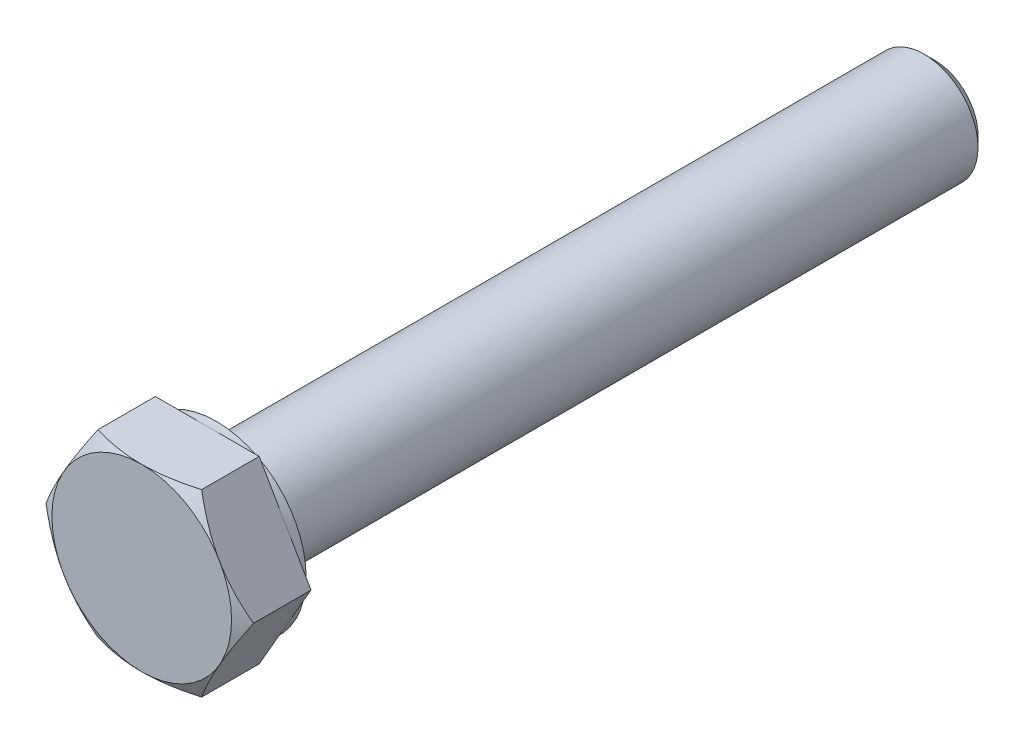
ISO-10303-21;
HEADER;
FILE_DESCRIPTION(('STEP AP214'),'2;1');
FILE_NAME('part.step','',(''),(''),'','','');
FILE_SCHEMA(('AUTOMOTIVE_DESIGN { 1 0 10303 214 1 1 1 1 }'));
ENDSEC;
DATA;
#1=APPLICATION_CONTEXT('core data for automotive mechanical design processes');
#2=APPLICATION_PROTOCOL_DEFINITION('international standard','automotive_design',2000,#1);
#3=PRODUCT_CONTEXT('',#1,'mechanical');
#4=PRODUCT('Part','Part','',(#3));
#5=PRODUCT_RELATED_PRODUCT_CATEGORY('part','',(#4));
#6=PRODUCT_DEFINITION_FORMATION('','',#4);
#7=PRODUCT_DEFINITION_CONTEXT('part definition',#1,'design');
#8=PRODUCT_DEFINITION('design','',#6,#7);
#9=PRODUCT_DEFINITION_SHAPE('','',#8);
#10=(LENGTH_UNIT() NAMED_UNIT(*) SI_UNIT(.MILLI.,.METRE.));
#11=(NAMED_UNIT(*) PLANE_ANGLE_UNIT() SI_UNIT($,.RADIAN.));
#12=(NAMED_UNIT(*) SI_UNIT($,.STERADIAN.) SOLID_ANGLE_UNIT());
#13=UNCERTAINTY_MEASURE_WITH_UNIT(LENGTH_MEASURE(1.E-05),#10,'distance_accuracy_value','');
#14=(GEOMETRIC_REPRESENTATION_CONTEXT(3) GLOBAL_UNCERTAINTY_ASSIGNED_CONTEXT((#13)) GLOBAL_UNIT_ASSIGNED_CONTEXT((#10,
#11,#12)) REPRESENTATION_CONTEXT('',''));
#15=CARTESIAN_POINT('',(0.,0.,0.));
#16=DIRECTION('',(0.,0.,1.));
#17=DIRECTION('',(1.,0.,0.));
#18=AXIS2_PLACEMENT_3D('',#15,#16,#17);
#19=CARTESIAN_POINT('',(0.,0.,4.15));
#20=DIRECTION('',(0.,0.,1.));
#21=DIRECTION('',(1.,0.,0.));
#22=AXIS2_PLACEMENT_3D('',#19,#20,#21);
#23=PLANE('',#22);
#24=CARTESIAN_POINT('',(0.,0.,4.15));
#25=DIRECTION('',(0.,0.,1.));
#26=DIRECTION('',(1.,0.,0.));
#27=AXIS2_PLACEMENT_3D('',#24,#25,#26);
#28=CIRCLE('',#27,5.);
#29=CARTESIAN_POINT('',(5.,0.,4.15));
#30=VERTEX_POINT('',#29);
#31=EDGE_CURVE('E10',#30,#30,#28,.T.);
#32=ORIENTED_EDGE('',*,*,#31,.T.);
#33=EDGE_LOOP('',(#32));
#34=FACE_BOUND('',#33,.T.);
#35=ADVANCED_FACE('F15',(#34),#23,.T.);
#36=CARTESIAN_POINT('',(0.,0.,4.15));
#37=DIRECTION('',(0.,0.,-1.));
#38=DIRECTION('',(1.,0.,0.));
#39=AXIS2_PLACEMENT_3D('',#36,#37,#38);
#40=CONICAL_SURFACE('',#39,5.,1.047197551197);
#41=CARTESIAN_POINT('',(2.8874999999992,5.00129670685568,3.70255354137743));
#42=CARTESIAN_POINT('',(4.33124999999986,2.50064835342825,4.53610299252072));
#43=CARTESIAN_POINT('',(5.77500000000043,9.62341317745086E-13,3.70255354137764));
#44=(BOUNDED_CURVE() B_SPLINE_CURVE(2,(#41,#42,#43),.UNSPECIFIED.,.F.,
.F.) B_SPLINE_CURVE_WITH_KNOTS((3,3),(0.,1.),
.UNSPECIFIED.) CURVE() GEOMETRIC_REPRESENTATION_ITEM() RATIONAL_B_SPLINE_CURVE((1.,
1.15470053837938,1.)) REPRESENTATION_ITEM(''));
#45=CARTESIAN_POINT('',(2.8875,5.001296706855,3.702553541378));
#46=VERTEX_POINT('',#45);
#47=CARTESIAN_POINT('',(5.775,0.,3.702553541378));
#48=VERTEX_POINT('',#47);
#49=EDGE_CURVE('E125',#46,#48,#44,.T.);
#50=ORIENTED_EDGE('',*,*,#49,.F.);
#51=CARTESIAN_POINT('',(-2.88750000000039,5.001296706855,3.70255354137778));
#52=CARTESIAN_POINT('',(-1.94066984704477E-13,5.00129670685504,4.53610299252048));
#53=CARTESIAN_POINT('',(2.88749999999987,5.001296706855,3.70255354137793));
#54=(BOUNDED_CURVE() B_SPLINE_CURVE(2,(#51,#52,#53),.UNSPECIFIED.,.F.,
.F.) B_SPLINE_CURVE_WITH_KNOTS((3,3),(0.,1.),
.UNSPECIFIED.) CURVE() GEOMETRIC_REPRESENTATION_ITEM() RATIONAL_B_SPLINE_CURVE((1.,
1.15470053837927,1.)) REPRESENTATION_ITEM(''));
#55=CARTESIAN_POINT('',(-2.8875,5.001296706855,3.702553541378));
#56=VERTEX_POINT('',#55);
#57=EDGE_CURVE('E111',#56,#46,#54,.T.);
#58=ORIENTED_EDGE('',*,*,#57,.F.);
#59=CARTESIAN_POINT('',(-5.7750000000016,-1.0627054791712E-12,3.70255354137697));
#60=CARTESIAN_POINT('',(-4.33125000000055,2.50064835342705,4.53610299252083));
#61=CARTESIAN_POINT('',(-2.88749999999986,5.00129670685454,3.70255354137781));
#62=(BOUNDED_CURVE() B_SPLINE_CURVE(2,(#59,#60,#61),.UNSPECIFIED.,.F.,
.F.) B_SPLINE_CURVE_WITH_KNOTS((3,3),(0.,1.),
.UNSPECIFIED.) CURVE() GEOMETRIC_REPRESENTATION_ITEM() RATIONAL_B_SPLINE_CURVE((1.,
1.15470053837943,1.)) REPRESENTATION_ITEM(''));
#63=CARTESIAN_POINT('',(-5.775,0.,3.702553541378));
#64=VERTEX_POINT('',#63);
#65=EDGE_CURVE('E159',#64,#56,#62,.T.);
#66=ORIENTED_EDGE('',*,*,#65,.F.);
#67=CARTESIAN_POINT('',(-2.8874999999992,-5.00129670685568,3.70255354137743));
#68=CARTESIAN_POINT('',(-4.33124999999987,-2.50064835342823,4.53610299252073));
#69=CARTESIAN_POINT('',(-5.77500000000045,-9.2104102122903E-13,3.70255354137763));
#70=(BOUNDED_CURVE() B_SPLINE_CURVE(2,(#67,#68,#69),.UNSPECIFIED.,.F.,
.F.) B_SPLINE_CURVE_WITH_KNOTS((3,3),(0.,1.),
.UNSPECIFIED.) CURVE() GEOMETRIC_REPRESENTATION_ITEM() RATIONAL_B_SPLINE_CURVE((1.,
1.15470053837938,1.)) REPRESENTATION_ITEM(''));
#71=CARTESIAN_POINT('',(-2.8875,-5.001296706855,3.702553541378));
#72=VERTEX_POINT('',#71);
#73=EDGE_CURVE('E171',#72,#64,#70,.T.);
#74=ORIENTED_EDGE('',*,*,#73,.F.);
#75=CARTESIAN_POINT('',(2.88750000000039,-5.001296706855,3.70255354137778));
#76=CARTESIAN_POINT('',(1.93622895494628E-13,-5.00129670685504,4.53610299252048));
#77=CARTESIAN_POINT('',(-2.88749999999987,-5.001296706855,3.70255354137793));
#78=(BOUNDED_CURVE() B_SPLINE_CURVE(2,(#75,#76,#77),.UNSPECIFIED.,.F.,
.F.) B_SPLINE_CURVE_WITH_KNOTS((3,3),(0.,1.),
.UNSPECIFIED.) CURVE() GEOMETRIC_REPRESENTATION_ITEM() RATIONAL_B_SPLINE_CURVE((1.,
1.15470053837927,1.)) REPRESENTATION_ITEM(''));
#79=CARTESIAN_POINT('',(2.8875,-5.001296706855,3.702553541378));
#80=VERTEX_POINT('',#79);
#81=EDGE_CURVE('E184',#80,#72,#78,.T.);
#82=ORIENTED_EDGE('',*,*,#81,.F.);
#83=CARTESIAN_POINT('',(5.77500000000167,1.18571819029967E-12,3.70255354137693));
#84=CARTESIAN_POINT('',(4.33125000000057,-2.50064835342701,4.53610299252084));
#85=CARTESIAN_POINT('',(2.88749999999986,-5.00129670685454,3.70255354137781));
#86=(BOUNDED_CURVE() B_SPLINE_CURVE(2,(#83,#84,#85),.UNSPECIFIED.,.F.,
.F.) B_SPLINE_CURVE_WITH_KNOTS((3,3),(0.,1.),
.UNSPECIFIED.) CURVE() GEOMETRIC_REPRESENTATION_ITEM() RATIONAL_B_SPLINE_CURVE((1.,
1.15470053837944,1.)) REPRESENTATION_ITEM(''));
#87=EDGE_CURVE('E18',#48,#80,#86,.T.);
#88=ORIENTED_EDGE('',*,*,#87,.F.);
#89=DIRECTION('',(0.866025403784329,0.,-0.50000000000019));
#90=VECTOR('',#89,1.);
#91=CARTESIAN_POINT('',(5.,0.,4.15));
#92=LINE('',#91,#90);
#93=EDGE_CURVE('E26',#30,#48,#92,.T.);
#94=ORIENTED_EDGE('',*,*,#93,.F.);
#95=ORIENTED_EDGE('',*,*,#31,.F.);
#96=ORIENTED_EDGE('',*,*,#93,.T.);
#97=EDGE_LOOP('',(#50,#58,#66,#74,#82,#88,#94,#95,#96));
#98=FACE_BOUND('',#97,.T.);
#99=ADVANCED_FACE('F126',(#98),#40,.T.);
#100=CARTESIAN_POINT('',(2.8875,-5.001296706855,0.));
#101=DIRECTION('',(-0.866025403784329,0.50000000000019,0.));
#102=DIRECTION('',(0.,0.,1.));
#103=AXIS2_PLACEMENT_3D('',#100,#101,#102);
#104=PLANE('',#103);
#105=DIRECTION('',(0.,0.,1.));
#106=VECTOR('',#105,1.);
#107=CARTESIAN_POINT('',(5.775,0.,0.5));
#108=LINE('',#107,#106);
#109=CARTESIAN_POINT('',(5.775,0.,0.5));
#110=VERTEX_POINT('',#109);
#111=EDGE_CURVE('E130',#110,#48,#108,.T.);
#112=ORIENTED_EDGE('',*,*,#111,.T.);
#113=ORIENTED_EDGE('',*,*,#87,.T.);
#114=DIRECTION('',(0.,0.,1.));
#115=VECTOR('',#114,1.);
#116=CARTESIAN_POINT('',(2.8875,-5.001296706855,0.));
#117=LINE('',#116,#115);
#118=CARTESIAN_POINT('',(2.8875,-5.001296706855,0.5));
#119=VERTEX_POINT('',#118);
#120=EDGE_CURVE('E176',#119,#80,#117,.T.);
#121=ORIENTED_EDGE('',*,*,#120,.F.);
#122=DIRECTION('',(0.50000000000019,0.866025403784329,0.));
#123=VECTOR('',#122,1.);
#124=CARTESIAN_POINT('',(3.609375,-3.750972530141,0.5));
#125=LINE('',#124,#123);
#126=EDGE_CURVE('E366',#119,#110,#125,.T.);
#127=ORIENTED_EDGE('',*,*,#126,.T.);
#128=EDGE_LOOP('',(#112,#113,#121,#127));
#129=FACE_BOUND('',#128,.T.);
#130=ADVANCED_FACE('F252',(#129),#104,.F.);
#131=CARTESIAN_POINT('',(-2.8875,-5.001296706855,0.));
#132=DIRECTION('',(0.,1.,0.));
#133=DIRECTION('',(1.,0.,0.));
#134=AXIS2_PLACEMENT_3D('',#131,#132,#133);
#135=PLANE('',#134);
#136=ORIENTED_EDGE('',*,*,#120,.T.);
#137=ORIENTED_EDGE('',*,*,#81,.T.);
#138=DIRECTION('',(0.,0.,1.));
#139=VECTOR('',#138,1.);
#140=CARTESIAN_POINT('',(-2.8875,-5.001296706855,0.));
#141=LINE('',#140,#139);
#142=CARTESIAN_POINT('',(-2.8875,-5.001296706855,0.5));
#143=VERTEX_POINT('',#142);
#144=EDGE_CURVE('E164',#143,#72,#141,.T.);
#145=ORIENTED_EDGE('',*,*,#144,.F.);
#146=DIRECTION('',(1.,0.,0.));
#147=VECTOR('',#146,1.);
#148=CARTESIAN_POINT('',(-1.44375,-5.001296706855,0.5));
#149=LINE('',#148,#147);
#150=EDGE_CURVE('E363',#143,#119,#149,.T.);
#151=ORIENTED_EDGE('',*,*,#150,.T.);
#152=EDGE_LOOP('',(#136,#137,#145,#151));
#153=FACE_BOUND('',#152,.T.);
#154=ADVANCED_FACE('F263',(#153),#135,.F.);
#155=CARTESIAN_POINT('',(-5.775,0.,0.));
#156=DIRECTION('',(0.866025403784329,0.50000000000019,0.));
#157=DIRECTION('',(0.,0.,-1.));
#158=AXIS2_PLACEMENT_3D('',#155,#156,#157);
#159=PLANE('',#158);
#160=ORIENTED_EDGE('',*,*,#144,.T.);
#161=ORIENTED_EDGE('',*,*,#73,.T.);
#162=DIRECTION('',(0.,0.,1.));
#163=VECTOR('',#162,1.);
#164=CARTESIAN_POINT('',(-5.775,0.,0.));
#165=LINE('',#164,#163);
#166=CARTESIAN_POINT('',(-5.775,0.,0.5));
#167=VERTEX_POINT('',#166);
#168=EDGE_CURVE('E122',#167,#64,#165,.T.);
#169=ORIENTED_EDGE('',*,*,#168,.F.);
#170=DIRECTION('',(0.50000000000019,-0.866025403784329,0.));
#171=VECTOR('',#170,1.);
#172=CARTESIAN_POINT('',(-5.053125,-1.250324176714,0.5));
#173=LINE('',#172,#171);
#174=EDGE_CURVE('E381',#167,#143,#173,.T.);
#175=ORIENTED_EDGE('',*,*,#174,.T.);
#176=EDGE_LOOP('',(#160,#161,#169,#175));
#177=FACE_BOUND('',#176,.T.);
#178=ADVANCED_FACE('F313',(#177),#159,.F.);
#179=CARTESIAN_POINT('',(-2.8875,5.001296706855,0.));
#180=DIRECTION('',(0.866025403784329,-0.50000000000019,0.));
#181=DIRECTION('',(0.,0.,-1.));
#182=AXIS2_PLACEMENT_3D('',#179,#180,#181);
#183=PLANE('',#182);
#184=ORIENTED_EDGE('',*,*,#168,.T.);
#185=ORIENTED_EDGE('',*,*,#65,.T.);
#186=DIRECTION('',(0.,0.,1.));
#187=VECTOR('',#186,1.);
#188=CARTESIAN_POINT('',(-2.8875,5.001296706855,0.));
#189=LINE('',#188,#187);
#190=CARTESIAN_POINT('',(-2.8875,5.001296706855,0.5));
#191=VERTEX_POINT('',#190);
#192=EDGE_CURVE('E118',#191,#56,#189,.T.);
#193=ORIENTED_EDGE('',*,*,#192,.F.);
#194=DIRECTION('',(-0.50000000000019,-0.866025403784329,0.));
#195=VECTOR('',#194,1.);
#196=CARTESIAN_POINT('',(-3.609375,3.750972530141,0.5));
#197=LINE('',#196,#195);
#198=EDGE_CURVE('E143',#191,#167,#197,.T.);
#199=ORIENTED_EDGE('',*,*,#198,.T.);
#200=EDGE_LOOP('',(#184,#185,#193,#199));
#201=FACE_BOUND('',#200,.T.);
#202=ADVANCED_FACE('F303',(#201),#183,.F.);
#203=CARTESIAN_POINT('',(2.8875,5.001296706855,0.));
#204=DIRECTION('',(0.,-1.,0.));
#205=DIRECTION('',(-1.,0.,0.));
#206=AXIS2_PLACEMENT_3D('',#203,#204,#205);
#207=PLANE('',#206);
#208=ORIENTED_EDGE('',*,*,#192,.T.);
#209=ORIENTED_EDGE('',*,*,#57,.T.);
#210=DIRECTION('',(0.,0.,1.));
#211=VECTOR('',#210,1.);
#212=CARTESIAN_POINT('',(2.8875,5.001296706855,0.));
#213=LINE('',#212,#211);
#214=CARTESIAN_POINT('',(2.8875,5.001296706855,0.5));
#215=VERTEX_POINT('',#214);
#216=EDGE_CURVE('E116',#215,#46,#213,.T.);
#217=ORIENTED_EDGE('',*,*,#216,.F.);
#218=DIRECTION('',(-1.,0.,0.));
#219=VECTOR('',#218,1.);
#220=CARTESIAN_POINT('',(1.44375,5.001296706855,0.5));
#221=LINE('',#220,#219);
#222=EDGE_CURVE('E137',#215,#191,#221,.T.);
#223=ORIENTED_EDGE('',*,*,#222,.T.);
#224=EDGE_LOOP('',(#208,#209,#217,#223));
#225=FACE_BOUND('',#224,.T.);
#226=ADVANCED_FACE('F113',(#225),#207,.F.);
#227=CARTESIAN_POINT('',(5.775,0.,0.));
#228=DIRECTION('',(-0.866025403784329,-0.50000000000019,0.));
#229=DIRECTION('',(-0.50000000000019,0.866025403784329,0.));
#230=AXIS2_PLACEMENT_3D('',#227,#228,#229);
#231=PLANE('',#230);
#232=ORIENTED_EDGE('',*,*,#216,.T.);
#233=ORIENTED_EDGE('',*,*,#49,.T.);
#234=ORIENTED_EDGE('',*,*,#111,.F.);
#235=DIRECTION('',(-0.50000000000019,0.866025403784329,0.));
#236=VECTOR('',#235,1.);
#237=CARTESIAN_POINT('',(5.053125,1.250324176714,0.5));
#238=LINE('',#237,#236);
#239=EDGE_CURVE('E135',#110,#215,#238,.T.);
#240=ORIENTED_EDGE('',*,*,#239,.T.);
#241=EDGE_LOOP('',(#232,#233,#234,#240));
#242=FACE_BOUND('',#241,.T.);
#243=ADVANCED_FACE('F133',(#242),#231,.F.);
#244=CARTESIAN_POINT('',(0.,0.,0.5));
#245=DIRECTION('',(0.,0.,1.));
#246=DIRECTION('',(1.,0.,0.));
#247=AXIS2_PLACEMENT_3D('',#244,#245,#246);
#248=PLANE('',#247);
#249=CARTESIAN_POINT('',(0.,0.,0.5));
#250=DIRECTION('',(0.,0.,1.));
#251=DIRECTION('',(1.,0.,0.));
#252=AXIS2_PLACEMENT_3D('',#249,#250,#251);
#253=CIRCLE('',#252,5.);
#254=CARTESIAN_POINT('',(5.,0.,0.5));
#255=VERTEX_POINT('',#254);
#256=EDGE_CURVE('E372',#255,#255,#253,.T.);
#257=ORIENTED_EDGE('',*,*,#256,.T.);
#258=EDGE_LOOP('',(#257));
#259=FACE_BOUND('',#258,.T.);
#260=ORIENTED_EDGE('',*,*,#239,.F.);
#261=ORIENTED_EDGE('',*,*,#126,.F.);
#262=ORIENTED_EDGE('',*,*,#150,.F.);
#263=ORIENTED_EDGE('',*,*,#174,.F.);
#264=ORIENTED_EDGE('',*,*,#198,.F.);
#265=ORIENTED_EDGE('',*,*,#222,.F.);
#266=EDGE_LOOP('',(#260,#261,#262,#263,#264,#265));
#267=FACE_BOUND('',#266,.T.);
#268=ADVANCED_FACE('F273',(#259,#267),#248,.F.);
#269=CARTESIAN_POINT('',(0.,0.,0.));
#270=DIRECTION('',(0.,0.,1.));
#271=DIRECTION('',(1.,0.,0.));
#272=AXIS2_PLACEMENT_3D('',#269,#270,#271);
#273=CYLINDRICAL_SURFACE('',#272,5.);
#274=CARTESIAN_POINT('',(0.,0.,0.));
#275=DIRECTION('',(0.,0.,1.));
#276=DIRECTION('',(1.,0.,0.));
#277=AXIS2_PLACEMENT_3D('',#274,#275,#276);
#278=CIRCLE('',#277,5.);
#279=CARTESIAN_POINT('',(5.,0.,0.));
#280=VERTEX_POINT('',#279);
#281=EDGE_CURVE('E393',#280,#280,#278,.T.);
#282=ORIENTED_EDGE('',*,*,#281,.T.);
#283=DIRECTION('',(0.,0.,1.));
#284=VECTOR('',#283,1.);
#285=CARTESIAN_POINT('',(5.,0.,0.));
#286=LINE('',#285,#284);
#287=EDGE_CURVE('E376',#280,#255,#286,.T.);
#288=ORIENTED_EDGE('',*,*,#287,.T.);
#289=ORIENTED_EDGE('',*,*,#256,.F.);
#290=ORIENTED_EDGE('',*,*,#287,.F.);
#291=EDGE_LOOP('',(#282,#288,#289,#290));
#292=FACE_BOUND('',#291,.T.);
#293=ADVANCED_FACE('F240',(#292),#273,.T.);
#294=CARTESIAN_POINT('',(0.,0.,0.));
#295=DIRECTION('',(0.,0.,1.));
#296=DIRECTION('',(1.,0.,0.));
#297=AXIS2_PLACEMENT_3D('',#294,#295,#296);
#298=PLANE('',#297);
#299=ORIENTED_EDGE('',*,*,#281,.F.);
#300=EDGE_LOOP('',(#299));
#301=FACE_BOUND('',#300,.T.);
#302=CARTESIAN_POINT('',(0.,0.,0.));
#303=DIRECTION('',(0.,0.,1.));
#304=DIRECTION('',(1.,0.,0.));
#305=AXIS2_PLACEMENT_3D('',#302,#303,#304);
#306=CIRCLE('',#305,3.);
#307=CARTESIAN_POINT('',(3.,0.,0.));
#308=VERTEX_POINT('',#307);
#309=EDGE_CURVE('E403',#308,#308,#306,.T.);
#310=ORIENTED_EDGE('',*,*,#309,.T.);
#311=EDGE_LOOP('',(#310));
#312=FACE_BOUND('',#311,.T.);
#313=ADVANCED_FACE('F229',(#301,#312),#298,.F.);
#314=CARTESIAN_POINT('',(0.,0.,-39.4));
#315=DIRECTION('',(0.,0.,1.));
#316=DIRECTION('',(1.,0.,0.));
#317=AXIS2_PLACEMENT_3D('',#314,#315,#316);
#318=CYLINDRICAL_SURFACE('',#317,3.);
#319=CARTESIAN_POINT('',(0.,0.,-39.4));
#320=DIRECTION('',(0.,0.,1.));
#321=DIRECTION('',(1.,0.,0.));
#322=AXIS2_PLACEMENT_3D('',#319,#320,#321);
#323=CIRCLE('',#322,3.);
#324=CARTESIAN_POINT('',(3.,0.,-39.4));
#325=VERTEX_POINT('',#324);
#326=EDGE_CURVE('E409',#325,#325,#323,.T.);
#327=ORIENTED_EDGE('',*,*,#326,.T.);
#328=DIRECTION('',(0.,0.,1.));
#329=VECTOR('',#328,1.);
#330=CARTESIAN_POINT('',(3.,0.,-39.4));
#331=LINE('',#330,#329);
#332=EDGE_CURVE('E406',#325,#308,#331,.T.);
#333=ORIENTED_EDGE('',*,*,#332,.T.);
#334=ORIENTED_EDGE('',*,*,#309,.F.);
#335=ORIENTED_EDGE('',*,*,#332,.F.);
#336=EDGE_LOOP('',(#327,#333,#334,#335));
#337=FACE_BOUND('',#336,.T.);
#338=ADVANCED_FACE('F218',(#337),#318,.T.);
#339=CARTESIAN_POINT('',(0.,0.,-40.));
#340=DIRECTION('',(0.,0.,1.));
#341=DIRECTION('',(1.,0.,0.));
#342=AXIS2_PLACEMENT_3D('',#339,#340,#341);
#343=CONICAL_SURFACE('',#342,2.4,0.785398163397);
#344=CARTESIAN_POINT('',(0.,0.,-40.));
#345=DIRECTION('',(0.,0.,1.));
#346=DIRECTION('',(1.,0.,0.));
#347=AXIS2_PLACEMENT_3D('',#344,#345,#346);
#348=CIRCLE('',#347,2.4);
#349=CARTESIAN_POINT('',(2.4,0.,-40.));
#350=VERTEX_POINT('',#349);
#351=EDGE_CURVE('E418',#350,#350,#348,.T.);
#352=ORIENTED_EDGE('',*,*,#351,.T.);
#353=DIRECTION('',(0.707106781186548,0.,0.707106781186548));
#354=VECTOR('',#353,1.);
#355=CARTESIAN_POINT('',(2.4,0.,-40.));
#356=LINE('',#355,#354);
#357=EDGE_CURVE('E414',#350,#325,#356,.T.);
#358=ORIENTED_EDGE('',*,*,#357,.T.);
#359=ORIENTED_EDGE('',*,*,#326,.F.);
#360=ORIENTED_EDGE('',*,*,#357,.F.);
#361=EDGE_LOOP('',(#352,#358,#359,#360));
#362=FACE_BOUND('',#361,.T.);
#363=ADVANCED_FACE('F205',(#362),#343,.T.);
#364=CARTESIAN_POINT('',(0.,0.,-40.));
#365=DIRECTION('',(0.,0.,1.));
#366=DIRECTION('',(1.,0.,0.));
#367=AXIS2_PLACEMENT_3D('',#364,#365,#366);
#368=PLANE('',#367);
#369=ORIENTED_EDGE('',*,*,#351,.F.);
#370=EDGE_LOOP('',(#369));
#371=FACE_BOUND('',#370,.T.);
#372=ADVANCED_FACE('F199',(#371),#368,.F.);
#373=CLOSED_SHELL('',(#35,#99,#130,#154,#178,#202,#226,#243,#268,#293,#313,#338,#363,#372));
#374=MANIFOLD_SOLID_BREP('B1',#373);
#375=ADVANCED_BREP_SHAPE_REPRESENTATION('',(#18,#374),#14);
#376=SHAPE_DEFINITION_REPRESENTATION(#9,#375);
ENDSEC;
END-ISO-10303-21;
